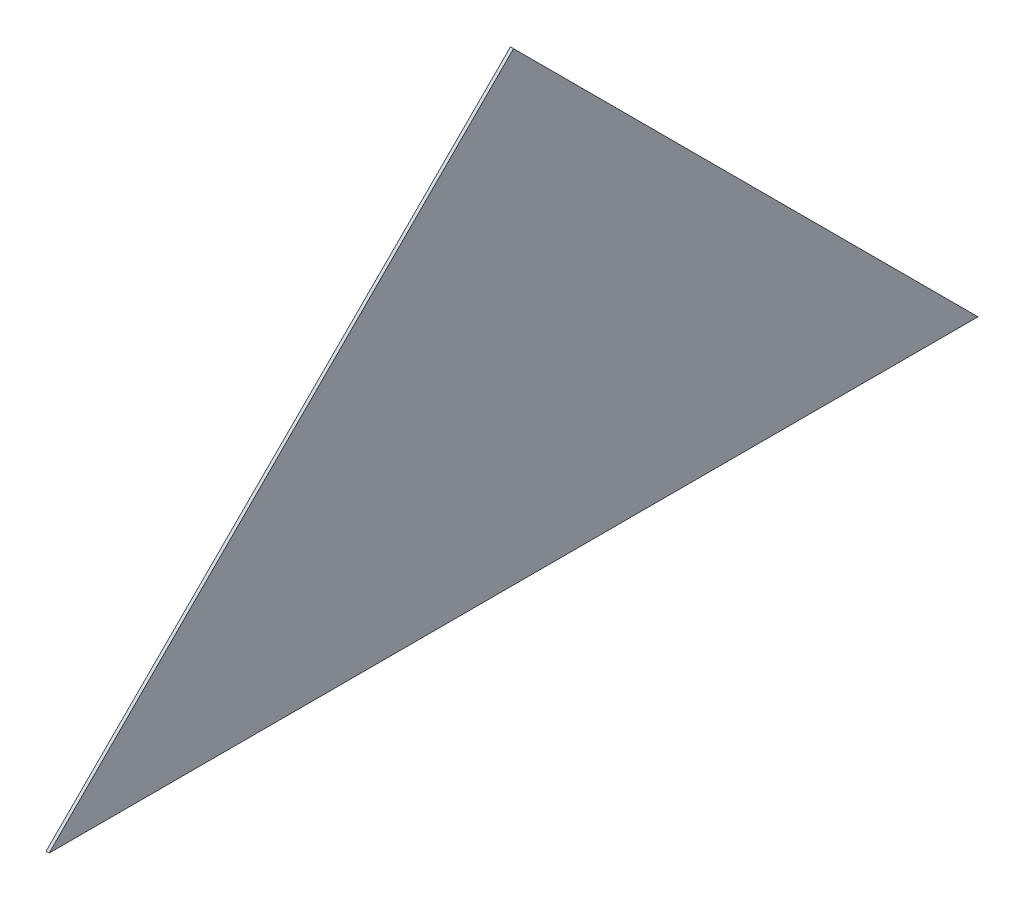
ISO-10303-21;
HEADER;
FILE_DESCRIPTION(('STEP AP214'),'2;1');
FILE_NAME('part.step','',(''),(''),'','','');
FILE_SCHEMA(('AUTOMOTIVE_DESIGN { 1 0 10303 214 1 1 1 1 }'));
ENDSEC;
DATA;
#1=APPLICATION_CONTEXT('core data for automotive mechanical design processes');
#2=APPLICATION_PROTOCOL_DEFINITION('international standard','automotive_design',2000,#1);
#3=PRODUCT_CONTEXT('',#1,'mechanical');
#4=PRODUCT('Part','Part','',(#3));
#5=PRODUCT_RELATED_PRODUCT_CATEGORY('part','',(#4));
#6=PRODUCT_DEFINITION_FORMATION('','',#4);
#7=PRODUCT_DEFINITION_CONTEXT('part definition',#1,'design');
#8=PRODUCT_DEFINITION('design','',#6,#7);
#9=PRODUCT_DEFINITION_SHAPE('','',#8);
#10=(LENGTH_UNIT() NAMED_UNIT(*) SI_UNIT(.MILLI.,.METRE.));
#11=(NAMED_UNIT(*) PLANE_ANGLE_UNIT() SI_UNIT($,.RADIAN.));
#12=(NAMED_UNIT(*) SI_UNIT($,.STERADIAN.) SOLID_ANGLE_UNIT());
#13=UNCERTAINTY_MEASURE_WITH_UNIT(LENGTH_MEASURE(1.E-05),#10,'distance_accuracy_value','');
#14=(GEOMETRIC_REPRESENTATION_CONTEXT(3) GLOBAL_UNCERTAINTY_ASSIGNED_CONTEXT((#13)) GLOBAL_UNIT_ASSIGNED_CONTEXT((#10,
#11,#12)) REPRESENTATION_CONTEXT('',''));
#15=CARTESIAN_POINT('',(0.,0.,0.));
#16=DIRECTION('',(0.,0.,1.));
#17=DIRECTION('',(1.,0.,0.));
#18=AXIS2_PLACEMENT_3D('',#15,#16,#17);
#19=CARTESIAN_POINT('',(10.,1500.,-1500.00004998001));
#20=DIRECTION('',(0.,-0.70710679296695,-0.707106769406145));
#21=DIRECTION('',(0.,0.707106769406145,-0.70710679296695));
#22=AXIS2_PLACEMENT_3D('',#19,#20,#21);
#23=PLANE('',#22);
#24=DIRECTION('',(0.,-0.707106769406145,0.70710679296695));
#25=VECTOR('',#24,1.);
#26=CARTESIAN_POINT('',(0.,1500.,-1500.00004998001));
#27=LINE('',#26,#25);
#28=CARTESIAN_POINT('',(0.,1500.,-1500.00004998001));
#29=VERTEX_POINT('',#28);
#30=CARTESIAN_POINT('',(0.,0.,0.));
#31=VERTEX_POINT('',#30);
#32=EDGE_CURVE('E89',#29,#31,#27,.T.);
#33=ORIENTED_EDGE('',*,*,#32,.T.);
#34=DIRECTION('',(-1.,0.,0.));
#35=VECTOR('',#34,1.);
#36=CARTESIAN_POINT('',(10.,0.,0.));
#37=LINE('',#36,#35);
#38=CARTESIAN_POINT('',(10.,0.,0.));
#39=VERTEX_POINT('',#38);
#40=EDGE_CURVE('E11',#39,#31,#37,.T.);
#41=ORIENTED_EDGE('',*,*,#40,.F.);
#42=DIRECTION('',(0.,-0.707106769406145,0.70710679296695));
#43=VECTOR('',#42,1.);
#44=CARTESIAN_POINT('',(10.,1500.,-1500.00004998001));
#45=LINE('',#44,#43);
#46=CARTESIAN_POINT('',(10.,1500.,-1500.00004998001));
#47=VERTEX_POINT('',#46);
#48=EDGE_CURVE('E81',#47,#39,#45,.T.);
#49=ORIENTED_EDGE('',*,*,#48,.F.);
#50=DIRECTION('',(-1.,0.,0.));
#51=VECTOR('',#50,1.);
#52=CARTESIAN_POINT('',(10.,1500.,-1500.00004998001));
#53=LINE('',#52,#51);
#54=EDGE_CURVE('E90',#47,#29,#53,.T.);
#55=ORIENTED_EDGE('',*,*,#54,.T.);
#56=EDGE_LOOP('',(#33,#41,#49,#55));
#57=FACE_BOUND('',#56,.T.);
#58=ADVANCED_FACE('F39',(#57),#23,.F.);
#59=CARTESIAN_POINT('',(10.,0.,0.));
#60=DIRECTION('',(0.,1.,0.));
#61=DIRECTION('',(0.,0.,1.));
#62=AXIS2_PLACEMENT_3D('',#59,#60,#61);
#63=PLANE('',#62);
#64=DIRECTION('',(0.,0.,-1.));
#65=VECTOR('',#64,1.);
#66=CARTESIAN_POINT('',(0.,0.,0.));
#67=LINE('',#66,#65);
#68=CARTESIAN_POINT('',(0.,1.66533453693773E-13,-3000.));
#69=VERTEX_POINT('',#68);
#70=EDGE_CURVE('E68',#31,#69,#67,.T.);
#71=ORIENTED_EDGE('',*,*,#70,.T.);
#72=DIRECTION('',(-1.,0.,0.));
#73=VECTOR('',#72,1.);
#74=CARTESIAN_POINT('',(10.,1.66533453693773E-13,-3000.));
#75=LINE('',#74,#73);
#76=CARTESIAN_POINT('',(10.,1.66533453693773E-13,-3000.));
#77=VERTEX_POINT('',#76);
#78=EDGE_CURVE('E48',#77,#69,#75,.T.);
#79=ORIENTED_EDGE('',*,*,#78,.F.);
#80=DIRECTION('',(0.,0.,-1.));
#81=VECTOR('',#80,1.);
#82=CARTESIAN_POINT('',(10.,0.,0.));
#83=LINE('',#82,#81);
#84=EDGE_CURVE('E76',#39,#77,#83,.T.);
#85=ORIENTED_EDGE('',*,*,#84,.F.);
#86=ORIENTED_EDGE('',*,*,#40,.T.);
#87=EDGE_LOOP('',(#71,#79,#85,#86));
#88=FACE_BOUND('',#87,.T.);
#89=ADVANCED_FACE('F77',(#88),#63,.F.);
#90=CARTESIAN_POINT('',(10.,1500.,-1500.00004998001));
#91=DIRECTION('',(0.,-0.707106769406145,0.70710679296695));
#92=DIRECTION('',(0.,-0.70710679296695,-0.707106769406145));
#93=AXIS2_PLACEMENT_3D('',#90,#91,#92);
#94=PLANE('',#93);
#95=DIRECTION('',(0.,0.70710679296695,0.707106769406145));
#96=VECTOR('',#95,1.);
#97=CARTESIAN_POINT('',(0.,1500.,-1500.00004998001));
#98=LINE('',#97,#96);
#99=EDGE_CURVE('E73',#69,#29,#98,.T.);
#100=ORIENTED_EDGE('',*,*,#99,.T.);
#101=ORIENTED_EDGE('',*,*,#54,.F.);
#102=DIRECTION('',(0.,0.70710679296695,0.707106769406145));
#103=VECTOR('',#102,1.);
#104=CARTESIAN_POINT('',(10.,1500.,-1500.00004998001));
#105=LINE('',#104,#103);
#106=EDGE_CURVE('E56',#77,#47,#105,.T.);
#107=ORIENTED_EDGE('',*,*,#106,.F.);
#108=ORIENTED_EDGE('',*,*,#78,.T.);
#109=EDGE_LOOP('',(#100,#101,#107,#108));
#110=FACE_BOUND('',#109,.T.);
#111=ADVANCED_FACE('F102',(#110),#94,.F.);
#112=CARTESIAN_POINT('',(10.,0.,0.));
#113=DIRECTION('',(1.,0.,0.));
#114=DIRECTION('',(0.,0.,-1.));
#115=AXIS2_PLACEMENT_3D('',#112,#113,#114);
#116=PLANE('',#115);
#117=ORIENTED_EDGE('',*,*,#48,.T.);
#118=ORIENTED_EDGE('',*,*,#84,.T.);
#119=ORIENTED_EDGE('',*,*,#106,.T.);
#120=EDGE_LOOP('',(#117,#118,#119));
#121=FACE_BOUND('',#120,.T.);
#122=ADVANCED_FACE('F84',(#121),#116,.T.);
#123=CARTESIAN_POINT('',(0.,0.,0.));
#124=DIRECTION('',(1.,0.,0.));
#125=DIRECTION('',(0.,0.,-1.));
#126=AXIS2_PLACEMENT_3D('',#123,#124,#125);
#127=PLANE('',#126);
#128=ORIENTED_EDGE('',*,*,#32,.F.);
#129=ORIENTED_EDGE('',*,*,#99,.F.);
#130=ORIENTED_EDGE('',*,*,#70,.F.);
#131=EDGE_LOOP('',(#128,#129,#130));
#132=FACE_BOUND('',#131,.T.);
#133=ADVANCED_FACE('F103',(#132),#127,.F.);
#134=CLOSED_SHELL('',(#58,#89,#111,#122,#133));
#135=MANIFOLD_SOLID_BREP('B2',#134);
#136=ADVANCED_BREP_SHAPE_REPRESENTATION('',(#18,#135),#14);
#137=SHAPE_DEFINITION_REPRESENTATION(#9,#136);
ENDSEC;
END-ISO-10303-21;
